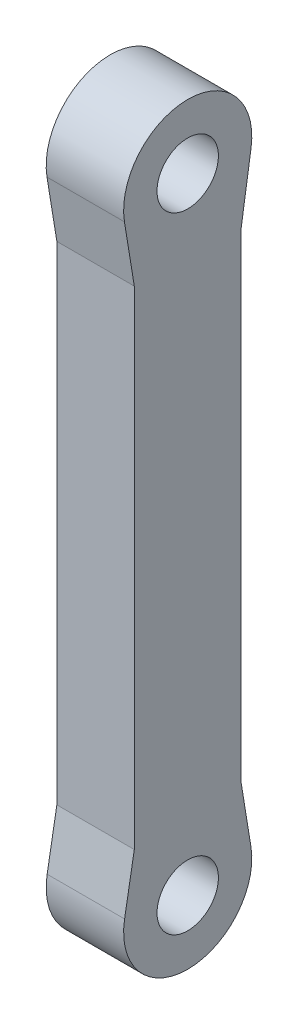
ISO-10303-21;
HEADER;
FILE_DESCRIPTION(('STEP AP214'),'2;1');
FILE_NAME('part.step','',(''),(''),'','','');
FILE_SCHEMA(('AUTOMOTIVE_DESIGN { 1 0 10303 214 1 1 1 1 }'));
ENDSEC;
DATA;
#1=APPLICATION_CONTEXT('core data for automotive mechanical design processes');
#2=APPLICATION_PROTOCOL_DEFINITION('international standard','automotive_design',2000,#1);
#3=PRODUCT_CONTEXT('',#1,'mechanical');
#4=PRODUCT('Part','Part','',(#3));
#5=PRODUCT_RELATED_PRODUCT_CATEGORY('part','',(#4));
#6=PRODUCT_DEFINITION_FORMATION('','',#4);
#7=PRODUCT_DEFINITION_CONTEXT('part definition',#1,'design');
#8=PRODUCT_DEFINITION('design','',#6,#7);
#9=PRODUCT_DEFINITION_SHAPE('','',#8);
#10=(LENGTH_UNIT() NAMED_UNIT(*) SI_UNIT(.MILLI.,.METRE.));
#11=(NAMED_UNIT(*) PLANE_ANGLE_UNIT() SI_UNIT($,.RADIAN.));
#12=(NAMED_UNIT(*) SI_UNIT($,.STERADIAN.) SOLID_ANGLE_UNIT());
#13=UNCERTAINTY_MEASURE_WITH_UNIT(LENGTH_MEASURE(1.E-05),#10,'distance_accuracy_value','');
#14=(GEOMETRIC_REPRESENTATION_CONTEXT(3) GLOBAL_UNCERTAINTY_ASSIGNED_CONTEXT((#13)) GLOBAL_UNIT_ASSIGNED_CONTEXT((#10,
#11,#12)) REPRESENTATION_CONTEXT('',''));
#15=CARTESIAN_POINT('',(0.,0.,0.));
#16=DIRECTION('',(0.,0.,1.));
#17=DIRECTION('',(1.,0.,0.));
#18=AXIS2_PLACEMENT_3D('',#15,#16,#17);
#19=CARTESIAN_POINT('',(0.,0.415759234538501,2.36371408139777));
#20=DIRECTION('',(0.,-0.173233014395521,-0.984880867274536));
#21=DIRECTION('',(0.,0.984880867274536,-0.173233014395521));
#22=AXIS2_PLACEMENT_3D('',#19,#20,#21);
#23=PLANE('',#22);
#24=DIRECTION('',(0.,-0.984880867306427,0.173233014214207));
#25=VECTOR('',#24,1.);
#26=CARTESIAN_POINT('',(0.,2.483581244,2.));
#27=LINE('',#26,#25);
#28=CARTESIAN_POINT('',(0.,2.483581244,2.));
#29=VERTEX_POINT('',#28);
#30=CARTESIAN_POINT('',(0.,0.415759234318664,2.36371408104949));
#31=VERTEX_POINT('',#30);
#32=EDGE_CURVE('E92',#29,#31,#27,.T.);
#33=ORIENTED_EDGE('',*,*,#32,.T.);
#34=DIRECTION('',(1.,0.,0.));
#35=VECTOR('',#34,1.);
#36=CARTESIAN_POINT('',(1.45,0.4157592346,2.363714081));
#37=LINE('',#36,#35);
#38=CARTESIAN_POINT('',(2.9,0.415759234318664,2.36371408104949));
#39=VERTEX_POINT('',#38);
#40=EDGE_CURVE('E143',#31,#39,#37,.T.);
#41=ORIENTED_EDGE('',*,*,#40,.T.);
#42=DIRECTION('',(0.,0.984880867306427,-0.173233014214207));
#43=VECTOR('',#42,1.);
#44=CARTESIAN_POINT('',(2.9,0.4157592346,2.363714081));
#45=LINE('',#44,#43);
#46=CARTESIAN_POINT('',(2.9,2.483581244,2.));
#47=VERTEX_POINT('',#46);
#48=EDGE_CURVE('E94',#39,#47,#45,.T.);
#49=ORIENTED_EDGE('',*,*,#48,.T.);
#50=DIRECTION('',(-1.,0.,0.));
#51=VECTOR('',#50,1.);
#52=CARTESIAN_POINT('',(0.,2.483581244,2.));
#53=LINE('',#52,#51);
#54=EDGE_CURVE('E90',#47,#29,#53,.T.);
#55=ORIENTED_EDGE('',*,*,#54,.T.);
#56=EDGE_LOOP('',(#33,#41,#49,#55));
#57=FACE_BOUND('',#56,.T.);
#58=ADVANCED_FACE('F17',(#57),#23,.F.);
#59=CARTESIAN_POINT('',(0.,0.,0.));
#60=DIRECTION('',(1.,0.,0.));
#61=DIRECTION('',(0.,0.,-1.));
#62=AXIS2_PLACEMENT_3D('',#59,#60,#61);
#63=CYLINDRICAL_SURFACE('',#62,2.39999999955684);
#64=CARTESIAN_POINT('',(0.,0.,0.));
#65=DIRECTION('',(1.,0.,0.));
#66=DIRECTION('',(0.,0.,-1.));
#67=AXIS2_PLACEMENT_3D('',#64,#65,#66);
#68=CIRCLE('',#67,2.39999999955684);
#69=CARTESIAN_POINT('',(0.,0.384950566445129,-2.36892656308205));
#70=VERTEX_POINT('',#69);
#71=EDGE_CURVE('E108',#31,#70,#68,.T.);
#72=ORIENTED_EDGE('',*,*,#71,.T.);
#73=DIRECTION('',(1.,0.,0.));
#74=VECTOR('',#73,1.);
#75=CARTESIAN_POINT('',(0.,0.384950566523156,-2.3689265631425));
#76=LINE('',#75,#74);
#77=CARTESIAN_POINT('',(2.9,0.384950566445129,-2.36892656308205));
#78=VERTEX_POINT('',#77);
#79=EDGE_CURVE('E65',#70,#78,#76,.T.);
#80=ORIENTED_EDGE('',*,*,#79,.T.);
#81=CARTESIAN_POINT('',(2.9,0.,0.));
#82=DIRECTION('',(1.,0.,0.));
#83=DIRECTION('',(0.,0.,-1.));
#84=AXIS2_PLACEMENT_3D('',#81,#82,#83);
#85=CIRCLE('',#84,2.39999999955684);
#86=EDGE_CURVE('E20',#78,#39,#85,.F.);
#87=ORIENTED_EDGE('',*,*,#86,.T.);
#88=ORIENTED_EDGE('',*,*,#40,.F.);
#89=EDGE_LOOP('',(#72,#80,#87,#88));
#90=FACE_BOUND('',#89,.T.);
#91=ADVANCED_FACE('F206',(#90),#63,.T.);
#92=CARTESIAN_POINT('',(0.,0.38495056657528,-2.36892656313403));
#93=DIRECTION('',(0.,0.160396069403183,-0.987052734619589));
#94=DIRECTION('',(0.,0.987052734619589,0.160396069403183));
#95=AXIS2_PLACEMENT_3D('',#92,#93,#94);
#96=PLANE('',#95);
#97=DIRECTION('',(0.,0.987052734632117,0.160396069326091));
#98=VECTOR('',#97,1.);
#99=CARTESIAN_POINT('',(0.,0.3849505665,-2.368926563));
#100=LINE('',#99,#98);
#101=CARTESIAN_POINT('',(0.,2.655267878,-2.));
#102=VERTEX_POINT('',#101);
#103=EDGE_CURVE('E140',#70,#102,#100,.T.);
#104=ORIENTED_EDGE('',*,*,#103,.T.);
#105=DIRECTION('',(1.,0.,0.));
#106=VECTOR('',#105,1.);
#107=CARTESIAN_POINT('',(0.,2.655267878,-2.));
#108=LINE('',#107,#106);
#109=CARTESIAN_POINT('',(2.9,2.65526787799906,-2.));
#110=VERTEX_POINT('',#109);
#111=EDGE_CURVE('E75',#102,#110,#108,.T.);
#112=ORIENTED_EDGE('',*,*,#111,.T.);
#113=DIRECTION('',(0.,-0.987052734632117,-0.160396069326091));
#114=VECTOR('',#113,1.);
#115=CARTESIAN_POINT('',(2.9,2.655267878,-2.));
#116=LINE('',#115,#114);
#117=EDGE_CURVE('E126',#110,#78,#116,.T.);
#118=ORIENTED_EDGE('',*,*,#117,.T.);
#119=ORIENTED_EDGE('',*,*,#79,.F.);
#120=EDGE_LOOP('',(#104,#112,#118,#119));
#121=FACE_BOUND('',#120,.T.);
#122=ADVANCED_FACE('F204',(#121),#96,.T.);
#123=CARTESIAN_POINT('',(0.,0.,-2.));
#124=DIRECTION('',(0.,0.,1.));
#125=DIRECTION('',(1.,0.,0.));
#126=AXIS2_PLACEMENT_3D('',#123,#124,#125);
#127=PLANE('',#126);
#128=DIRECTION('',(0.,1.,0.));
#129=VECTOR('',#128,1.);
#130=CARTESIAN_POINT('',(0.,0.,-2.));
#131=LINE('',#130,#129);
#132=CARTESIAN_POINT('',(0.,20.6276628700495,-1.99999999967893));
#133=VERTEX_POINT('',#132);
#134=EDGE_CURVE('E136',#102,#133,#131,.T.);
#135=ORIENTED_EDGE('',*,*,#134,.T.);
#136=DIRECTION('',(1.,0.,0.));
#137=VECTOR('',#136,1.);
#138=CARTESIAN_POINT('',(0.,20.6276628701483,-1.99999999903677));
#139=LINE('',#138,#137);
#140=CARTESIAN_POINT('',(2.9,20.6276628700495,-1.99999999967893));
#141=VERTEX_POINT('',#140);
#142=EDGE_CURVE('E132',#133,#141,#139,.T.);
#143=ORIENTED_EDGE('',*,*,#142,.T.);
#144=DIRECTION('',(0.,1.,0.));
#145=VECTOR('',#144,1.);
#146=CARTESIAN_POINT('',(2.9,0.,-2.));
#147=LINE('',#146,#145);
#148=EDGE_CURVE('E128',#141,#110,#147,.F.);
#149=ORIENTED_EDGE('',*,*,#148,.T.);
#150=ORIENTED_EDGE('',*,*,#111,.F.);
#151=EDGE_LOOP('',(#135,#143,#149,#150));
#152=FACE_BOUND('',#151,.T.);
#153=ADVANCED_FACE('F176',(#152),#127,.F.);
#154=CARTESIAN_POINT('',(0.,0.,0.));
#155=DIRECTION('',(1.,0.,0.));
#156=DIRECTION('',(0.,0.,-1.));
#157=AXIS2_PLACEMENT_3D('',#154,#155,#156);
#158=CYLINDRICAL_SURFACE('',#157,1.15);
#159=CARTESIAN_POINT('',(0.,0.,0.));
#160=DIRECTION('',(1.,0.,0.));
#161=DIRECTION('',(0.,0.,-1.));
#162=AXIS2_PLACEMENT_3D('',#159,#160,#161);
#163=CIRCLE('',#162,1.15);
#164=CARTESIAN_POINT('',(0.,0.,-1.15));
#165=VERTEX_POINT('',#164);
#166=EDGE_CURVE('E154',#165,#165,#163,.F.);
#167=ORIENTED_EDGE('',*,*,#166,.T.);
#168=EDGE_LOOP('',(#167));
#169=FACE_BOUND('',#168,.T.);
#170=CARTESIAN_POINT('',(2.9,0.,0.));
#171=DIRECTION('',(1.,0.,0.));
#172=DIRECTION('',(0.,0.,-1.));
#173=AXIS2_PLACEMENT_3D('',#170,#171,#172);
#174=CIRCLE('',#173,1.15);
#175=CARTESIAN_POINT('',(2.9,0.,-1.15));
#176=VERTEX_POINT('',#175);
#177=EDGE_CURVE('E125',#176,#176,#174,.T.);
#178=ORIENTED_EDGE('',*,*,#177,.T.);
#179=EDGE_LOOP('',(#178));
#180=FACE_BOUND('',#179,.T.);
#181=ADVANCED_FACE('F162',(#169,#180),#158,.F.);
#182=CARTESIAN_POINT('',(0.,23.41,0.));
#183=DIRECTION('',(1.,0.,0.));
#184=DIRECTION('',(0.,0.,-1.));
#185=AXIS2_PLACEMENT_3D('',#182,#183,#184);
#186=CYLINDRICAL_SURFACE('',#185,1.15);
#187=CARTESIAN_POINT('',(0.,23.41,0.));
#188=DIRECTION('',(1.,0.,0.));
#189=DIRECTION('',(0.,0.,-1.));
#190=AXIS2_PLACEMENT_3D('',#187,#188,#189);
#191=CIRCLE('',#190,1.15);
#192=CARTESIAN_POINT('',(0.,23.41,-1.15));
#193=VERTEX_POINT('',#192);
#194=EDGE_CURVE('E151',#193,#193,#191,.F.);
#195=ORIENTED_EDGE('',*,*,#194,.T.);
#196=EDGE_LOOP('',(#195));
#197=FACE_BOUND('',#196,.T.);
#198=CARTESIAN_POINT('',(2.9,23.41,0.));
#199=DIRECTION('',(1.,0.,0.));
#200=DIRECTION('',(0.,0.,-1.));
#201=AXIS2_PLACEMENT_3D('',#198,#199,#200);
#202=CIRCLE('',#201,1.15);
#203=CARTESIAN_POINT('',(2.9,23.41,-1.15));
#204=VERTEX_POINT('',#203);
#205=EDGE_CURVE('E120',#204,#204,#202,.T.);
#206=ORIENTED_EDGE('',*,*,#205,.T.);
#207=EDGE_LOOP('',(#206));
#208=FACE_BOUND('',#207,.T.);
#209=ADVANCED_FACE('F195',(#197,#208),#186,.F.);
#210=CARTESIAN_POINT('',(0.,0.176682144820383,1.14786478609267));
#211=DIRECTION('',(0.,-0.152130835497074,-0.98836036388099));
#212=DIRECTION('',(0.,0.98836036388099,-0.152130835497074));
#213=AXIS2_PLACEMENT_3D('',#210,#211,#212);
#214=PLANE('',#213);
#215=DIRECTION('',(0.,0.988360363853796,-0.152130835673744));
#216=VECTOR('',#215,1.);
#217=CARTESIAN_POINT('',(0.,20.62766287,-2.));
#218=LINE('',#217,#216);
#219=CARTESIAN_POINT('',(0.,23.0448859921595,-2.3720648733324));
#220=VERTEX_POINT('',#219);
#221=EDGE_CURVE('E139',#133,#220,#218,.T.);
#222=ORIENTED_EDGE('',*,*,#221,.T.);
#223=DIRECTION('',(1.,0.,0.));
#224=VECTOR('',#223,1.);
#225=CARTESIAN_POINT('',(1.45,23.04488599,-2.372064873));
#226=LINE('',#225,#224);
#227=CARTESIAN_POINT('',(2.9,23.0448859921595,-2.3720648733324));
#228=VERTEX_POINT('',#227);
#229=EDGE_CURVE('E123',#220,#228,#226,.T.);
#230=ORIENTED_EDGE('',*,*,#229,.T.);
#231=DIRECTION('',(0.,-0.988360363853796,0.152130835673744));
#232=VECTOR('',#231,1.);
#233=CARTESIAN_POINT('',(2.9,23.04488599,-2.372064873));
#234=LINE('',#233,#232);
#235=EDGE_CURVE('E129',#228,#141,#234,.T.);
#236=ORIENTED_EDGE('',*,*,#235,.T.);
#237=ORIENTED_EDGE('',*,*,#142,.F.);
#238=EDGE_LOOP('',(#222,#230,#236,#237));
#239=FACE_BOUND('',#238,.T.);
#240=ADVANCED_FACE('F167',(#239),#214,.T.);
#241=CARTESIAN_POINT('',(2.9,0.,0.));
#242=DIRECTION('',(1.,0.,0.));
#243=DIRECTION('',(0.,0.,-1.));
#244=AXIS2_PLACEMENT_3D('',#241,#242,#243);
#245=PLANE('',#244);
#246=ORIENTED_EDGE('',*,*,#205,.F.);
#247=EDGE_LOOP('',(#246));
#248=FACE_BOUND('',#247,.T.);
#249=ORIENTED_EDGE('',*,*,#177,.F.);
#250=EDGE_LOOP('',(#249));
#251=FACE_BOUND('',#250,.T.);
#252=DIRECTION('',(0.,1.,0.));
#253=VECTOR('',#252,1.);
#254=CARTESIAN_POINT('',(2.9,0.,2.));
#255=LINE('',#254,#253);
#256=CARTESIAN_POINT('',(2.9,20.7547321199522,2.00000000019605));
#257=VERTEX_POINT('',#256);
#258=EDGE_CURVE('E99',#257,#47,#255,.F.);
#259=ORIENTED_EDGE('',*,*,#258,.T.);
#260=ORIENTED_EDGE('',*,*,#48,.F.);
#261=ORIENTED_EDGE('',*,*,#86,.F.);
#262=ORIENTED_EDGE('',*,*,#117,.F.);
#263=ORIENTED_EDGE('',*,*,#148,.F.);
#264=ORIENTED_EDGE('',*,*,#235,.F.);
#265=CARTESIAN_POINT('',(2.9,23.41,0.));
#266=DIRECTION('',(1.,0.,0.));
#267=DIRECTION('',(0.,0.,-1.));
#268=AXIS2_PLACEMENT_3D('',#265,#266,#267);
#269=CIRCLE('',#268,2.40000000042058);
#270=CARTESIAN_POINT('',(2.9,23.0250494316409,2.36892656350674));
#271=VERTEX_POINT('',#270);
#272=EDGE_CURVE('E148',#228,#271,#269,.T.);
#273=ORIENTED_EDGE('',*,*,#272,.T.);
#274=DIRECTION('',(0.,0.987052734619589,0.160396069403183));
#275=VECTOR('',#274,1.);
#276=CARTESIAN_POINT('',(2.9,0.217316140782406,-1.33733009689321));
#277=LINE('',#276,#275);
#278=EDGE_CURVE('E118',#271,#257,#277,.F.);
#279=ORIENTED_EDGE('',*,*,#278,.T.);
#280=EDGE_LOOP('',(#259,#260,#261,#262,#263,#264,#273,#279));
#281=FACE_BOUND('',#280,.T.);
#282=ADVANCED_FACE('F164',(#248,#251,#281),#245,.T.);
#283=CARTESIAN_POINT('',(0.,0.,2.));
#284=DIRECTION('',(0.,0.,-1.));
#285=DIRECTION('',(-1.,0.,0.));
#286=AXIS2_PLACEMENT_3D('',#283,#284,#285);
#287=PLANE('',#286);
#288=DIRECTION('',(0.,1.,0.));
#289=VECTOR('',#288,1.);
#290=CARTESIAN_POINT('',(0.,0.,2.));
#291=LINE('',#290,#289);
#292=CARTESIAN_POINT('',(0.,20.7547321199522,2.00000000019605));
#293=VERTEX_POINT('',#292);
#294=EDGE_CURVE('E98',#293,#29,#291,.F.);
#295=ORIENTED_EDGE('',*,*,#294,.T.);
#296=ORIENTED_EDGE('',*,*,#54,.F.);
#297=ORIENTED_EDGE('',*,*,#258,.F.);
#298=DIRECTION('',(1.,0.,0.));
#299=VECTOR('',#298,1.);
#300=CARTESIAN_POINT('',(0.,20.7547321199522,2.00000000029407));
#301=LINE('',#300,#299);
#302=EDGE_CURVE('E113',#257,#293,#301,.F.);
#303=ORIENTED_EDGE('',*,*,#302,.T.);
#304=EDGE_LOOP('',(#295,#296,#297,#303));
#305=FACE_BOUND('',#304,.T.);
#306=ADVANCED_FACE('F111',(#305),#287,.F.);
#307=CARTESIAN_POINT('',(0.,0.,0.));
#308=DIRECTION('',(1.,0.,0.));
#309=DIRECTION('',(0.,0.,-1.));
#310=AXIS2_PLACEMENT_3D('',#307,#308,#309);
#311=PLANE('',#310);
#312=ORIENTED_EDGE('',*,*,#194,.F.);
#313=EDGE_LOOP('',(#312));
#314=FACE_BOUND('',#313,.T.);
#315=ORIENTED_EDGE('',*,*,#166,.F.);
#316=EDGE_LOOP('',(#315));
#317=FACE_BOUND('',#316,.T.);
#318=ORIENTED_EDGE('',*,*,#221,.F.);
#319=ORIENTED_EDGE('',*,*,#134,.F.);
#320=ORIENTED_EDGE('',*,*,#103,.F.);
#321=ORIENTED_EDGE('',*,*,#71,.F.);
#322=ORIENTED_EDGE('',*,*,#32,.F.);
#323=ORIENTED_EDGE('',*,*,#294,.F.);
#324=DIRECTION('',(0.,0.987052734619589,0.160396069403183));
#325=VECTOR('',#324,1.);
#326=CARTESIAN_POINT('',(0.,0.217316140782406,-1.33733009689321));
#327=LINE('',#326,#325);
#328=CARTESIAN_POINT('',(0.,23.0250494316409,2.36892656350674));
#329=VERTEX_POINT('',#328);
#330=EDGE_CURVE('E26',#293,#329,#327,.T.);
#331=ORIENTED_EDGE('',*,*,#330,.T.);
#332=CARTESIAN_POINT('',(0.,23.41,0.));
#333=DIRECTION('',(1.,0.,0.));
#334=DIRECTION('',(0.,0.,-1.));
#335=AXIS2_PLACEMENT_3D('',#332,#333,#334);
#336=CIRCLE('',#335,2.40000000042058);
#337=EDGE_CURVE('E34',#329,#220,#336,.F.);
#338=ORIENTED_EDGE('',*,*,#337,.T.);
#339=EDGE_LOOP('',(#318,#319,#320,#321,#322,#323,#331,#338));
#340=FACE_BOUND('',#339,.T.);
#341=ADVANCED_FACE('F104',(#314,#317,#340),#311,.F.);
#342=CARTESIAN_POINT('',(0.,23.41,0.));
#343=DIRECTION('',(1.,0.,0.));
#344=DIRECTION('',(0.,0.,-1.));
#345=AXIS2_PLACEMENT_3D('',#342,#343,#344);
#346=CYLINDRICAL_SURFACE('',#345,2.40000000042058);
#347=ORIENTED_EDGE('',*,*,#337,.F.);
#348=DIRECTION('',(1.,0.,0.));
#349=VECTOR('',#348,1.);
#350=CARTESIAN_POINT('',(0.,23.025049429962,2.36892656323391));
#351=LINE('',#350,#349);
#352=EDGE_CURVE('E11',#329,#271,#351,.T.);
#353=ORIENTED_EDGE('',*,*,#352,.T.);
#354=ORIENTED_EDGE('',*,*,#272,.F.);
#355=ORIENTED_EDGE('',*,*,#229,.F.);
#356=EDGE_LOOP('',(#347,#353,#354,#355));
#357=FACE_BOUND('',#356,.T.);
#358=ADVANCED_FACE('F179',(#357),#346,.T.);
#359=CARTESIAN_POINT('',(0.,0.217316140782406,-1.33733009689321));
#360=DIRECTION('',(0.,0.160396069403183,-0.987052734619589));
#361=DIRECTION('',(0.,0.987052734619589,0.160396069403183));
#362=AXIS2_PLACEMENT_3D('',#359,#360,#361);
#363=PLANE('',#362);
#364=ORIENTED_EDGE('',*,*,#330,.F.);
#365=ORIENTED_EDGE('',*,*,#302,.F.);
#366=ORIENTED_EDGE('',*,*,#278,.F.);
#367=ORIENTED_EDGE('',*,*,#352,.F.);
#368=EDGE_LOOP('',(#364,#365,#366,#367));
#369=FACE_BOUND('',#368,.T.);
#370=ADVANCED_FACE('F171',(#369),#363,.F.);
#371=CLOSED_SHELL('',(#58,#91,#122,#153,#181,#209,#240,#282,#306,#341,#358,#370));
#372=MANIFOLD_SOLID_BREP('B1',#371);
#373=ADVANCED_BREP_SHAPE_REPRESENTATION('',(#18,#372),#14);
#374=SHAPE_DEFINITION_REPRESENTATION(#9,#373);
ENDSEC;
END-ISO-10303-21;
